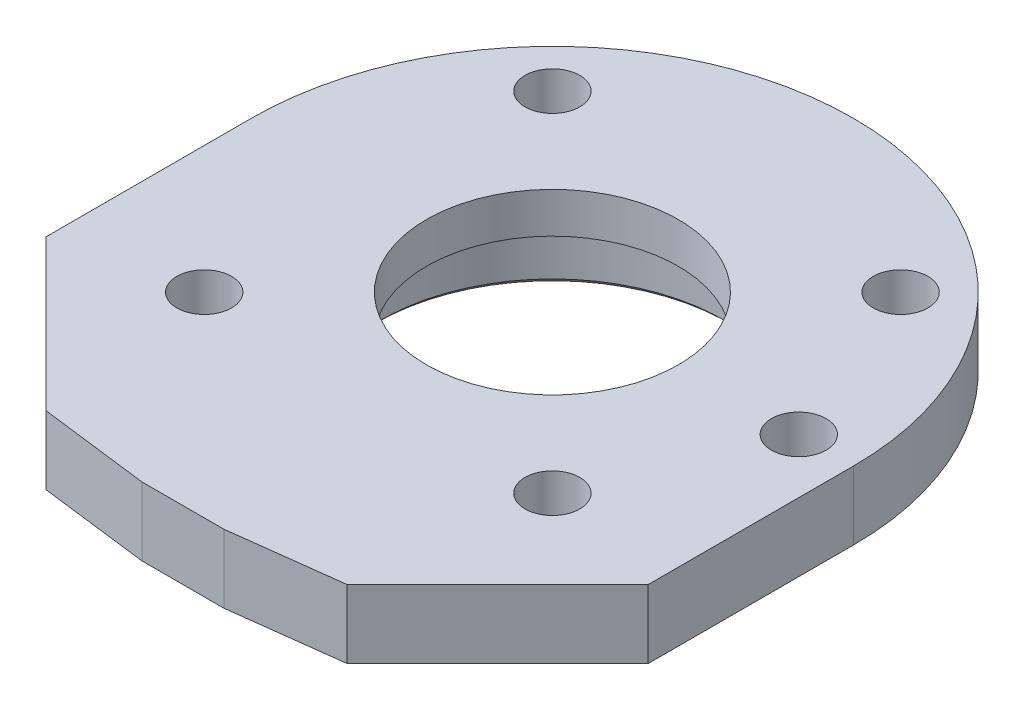
ISO-10303-21;
HEADER;
FILE_DESCRIPTION(('STEP AP214'),'2;1');
FILE_NAME('part.step','',(''),(''),'','','');
FILE_SCHEMA(('AUTOMOTIVE_DESIGN { 1 0 10303 214 1 1 1 1 }'));
ENDSEC;
DATA;
#1=APPLICATION_CONTEXT('core data for automotive mechanical design processes');
#2=APPLICATION_PROTOCOL_DEFINITION('international standard','automotive_design',2000,#1);
#3=PRODUCT_CONTEXT('',#1,'mechanical');
#4=PRODUCT('Part','Part','',(#3));
#5=PRODUCT_RELATED_PRODUCT_CATEGORY('part','',(#4));
#6=PRODUCT_DEFINITION_FORMATION('','',#4);
#7=PRODUCT_DEFINITION_CONTEXT('part definition',#1,'design');
#8=PRODUCT_DEFINITION('design','',#6,#7);
#9=PRODUCT_DEFINITION_SHAPE('','',#8);
#10=(LENGTH_UNIT() NAMED_UNIT(*) SI_UNIT(.MILLI.,.METRE.));
#11=(NAMED_UNIT(*) PLANE_ANGLE_UNIT() SI_UNIT($,.RADIAN.));
#12=(NAMED_UNIT(*) SI_UNIT($,.STERADIAN.) SOLID_ANGLE_UNIT());
#13=UNCERTAINTY_MEASURE_WITH_UNIT(LENGTH_MEASURE(1.E-05),#10,'distance_accuracy_value','');
#14=(GEOMETRIC_REPRESENTATION_CONTEXT(3) GLOBAL_UNCERTAINTY_ASSIGNED_CONTEXT((#13)) GLOBAL_UNIT_ASSIGNED_CONTEXT((#10,
#11,#12)) REPRESENTATION_CONTEXT('',''));
#15=CARTESIAN_POINT('',(0.,0.,0.));
#16=DIRECTION('',(0.,0.,1.));
#17=DIRECTION('',(1.,0.,0.));
#18=AXIS2_PLACEMENT_3D('',#15,#16,#17);
#19=CARTESIAN_POINT('',(0.,7.99999999999898,-8.32667268468867E-13));
#20=DIRECTION('',(0.,-1.,0.));
#21=DIRECTION('',(1.00000000000001,0.,0.));
#22=AXIS2_PLACEMENT_3D('',#19,#20,#21);
#23=CONICAL_SURFACE('',#22,64.499999999999,0.785398163396999);
#24=CARTESIAN_POINT('',(0.,7.99999999999898,-8.32667268468867E-13));
#25=DIRECTION('',(0.,-1.,0.));
#26=DIRECTION('',(1.00000000000001,0.,0.));
#27=AXIS2_PLACEMENT_3D('',#24,#25,#26);
#28=CIRCLE('',#27,64.499999999999);
#29=CARTESIAN_POINT('',(64.4999999999998,7.99999999999898,-8.32667268468868E-13));
#30=VERTEX_POINT('',#29);
#31=EDGE_CURVE('E19',#30,#30,#28,.T.);
#32=ORIENTED_EDGE('',*,*,#31,.T.);
#33=EDGE_LOOP('',(#32));
#34=FACE_BOUND('',#33,.T.);
#35=CARTESIAN_POINT('',(0.,9.99999999999999,-8.32667268468867E-13));
#36=DIRECTION('',(0.,1.,0.));
#37=DIRECTION('',(0.,0.,1.00000000000001));
#38=AXIS2_PLACEMENT_3D('',#35,#36,#37);
#39=CIRCLE('',#38,62.5);
#40=CARTESIAN_POINT('',(0.,9.99999999999999,62.5));
#41=VERTEX_POINT('',#40);
#42=EDGE_CURVE('E202',#41,#41,#39,.T.);
#43=ORIENTED_EDGE('',*,*,#42,.T.);
#44=EDGE_LOOP('',(#43));
#45=FACE_BOUND('',#44,.T.);
#46=ADVANCED_FACE('F16',(#34,#45),#23,.F.);
#47=CARTESIAN_POINT('',(0.,8.00000000000001,-8.32667268468867E-13));
#48=DIRECTION('',(0.,1.,0.));
#49=DIRECTION('',(0.,0.,1.00000000000001));
#50=AXIS2_PLACEMENT_3D('',#47,#48,#49);
#51=CYLINDRICAL_SURFACE('',#50,62.5);
#52=CARTESIAN_POINT('',(0.,33.2000000000001,-8.32667268468867E-13));
#53=DIRECTION('',(0.,1.,0.));
#54=DIRECTION('',(0.,0.,1.00000000000001));
#55=AXIS2_PLACEMENT_3D('',#52,#53,#54);
#56=CIRCLE('',#55,62.5);
#57=CARTESIAN_POINT('',(0.,33.2000000000001,62.5));
#58=VERTEX_POINT('',#57);
#59=EDGE_CURVE('E268',#58,#58,#56,.T.);
#60=ORIENTED_EDGE('',*,*,#59,.T.);
#61=EDGE_LOOP('',(#60));
#62=FACE_BOUND('',#61,.T.);
#63=ORIENTED_EDGE('',*,*,#42,.F.);
#64=EDGE_LOOP('',(#63));
#65=FACE_BOUND('',#64,.T.);
#66=ADVANCED_FACE('F281',(#62,#65),#51,.F.);
#67=CARTESIAN_POINT('',(0.,8.00000000000001,-8.32667268468867E-13));
#68=DIRECTION('',(0.,1.,0.));
#69=DIRECTION('',(0.,0.,1.00000000000001));
#70=AXIS2_PLACEMENT_3D('',#67,#68,#69);
#71=PLANE('',#70);
#72=ORIENTED_EDGE('',*,*,#31,.F.);
#73=EDGE_LOOP('',(#72));
#74=FACE_BOUND('',#73,.T.);
#75=CARTESIAN_POINT('',(0.,8.00000000000013,-8.32667268468867E-13));
#76=DIRECTION('',(0.,1.,0.));
#77=DIRECTION('',(0.,0.,1.00000000000001));
#78=AXIS2_PLACEMENT_3D('',#75,#76,#77);
#79=CIRCLE('',#78,72.9999999999999);
#80=CARTESIAN_POINT('',(0.,8.00000000000013,73.));
#81=VERTEX_POINT('',#80);
#82=EDGE_CURVE('E266',#81,#81,#79,.T.);
#83=ORIENTED_EDGE('',*,*,#82,.F.);
#84=EDGE_LOOP('',(#83));
#85=FACE_BOUND('',#84,.T.);
#86=ADVANCED_FACE('F277',(#74,#85),#71,.F.);
#87=CARTESIAN_POINT('',(0.,33.2000000000001,-8.32667268468867E-13));
#88=DIRECTION('',(0.,1.,0.));
#89=DIRECTION('',(0.,0.,1.00000000000001));
#90=AXIS2_PLACEMENT_3D('',#87,#88,#89);
#91=PLANE('',#90);
#92=CARTESIAN_POINT('',(0.,33.2000000000001,-8.32667268468867E-13));
#93=DIRECTION('',(0.,1.,0.));
#94=DIRECTION('',(0.,0.,1.00000000000001));
#95=AXIS2_PLACEMENT_3D('',#92,#93,#94);
#96=CIRCLE('',#95,59.);
#97=CARTESIAN_POINT('',(0.,33.2000000000001,59.));
#98=VERTEX_POINT('',#97);
#99=EDGE_CURVE('E201',#98,#98,#96,.T.);
#100=ORIENTED_EDGE('',*,*,#99,.T.);
#101=EDGE_LOOP('',(#100));
#102=FACE_BOUND('',#101,.T.);
#103=ORIENTED_EDGE('',*,*,#59,.F.);
#104=EDGE_LOOP('',(#103));
#105=FACE_BOUND('',#104,.T.);
#106=ADVANCED_FACE('F280',(#102,#105),#91,.F.);
#107=CARTESIAN_POINT('',(0.,10.000000000001,-8.32667268468867E-13));
#108=DIRECTION('',(0.,1.,0.));
#109=DIRECTION('',(0.,0.,1.00000000000001));
#110=AXIS2_PLACEMENT_3D('',#107,#108,#109);
#111=CONICAL_SURFACE('',#110,74.999999999999,0.785398163397);
#112=ORIENTED_EDGE('',*,*,#82,.T.);
#113=EDGE_LOOP('',(#112));
#114=FACE_BOUND('',#113,.T.);
#115=CARTESIAN_POINT('',(0.,10.,-8.32667268468867E-13));
#116=DIRECTION('',(0.,1.,0.));
#117=DIRECTION('',(0.,0.,1.00000000000001));
#118=AXIS2_PLACEMENT_3D('',#115,#116,#117);
#119=CIRCLE('',#118,75.);
#120=CARTESIAN_POINT('',(0.,10.,75.0000000000002));
#121=VERTEX_POINT('',#120);
#122=EDGE_CURVE('E197',#121,#121,#119,.T.);
#123=ORIENTED_EDGE('',*,*,#122,.F.);
#124=EDGE_LOOP('',(#123));
#125=FACE_BOUND('',#124,.T.);
#126=ADVANCED_FACE('F285',(#114,#125),#111,.T.);
#127=CARTESIAN_POINT('',(0.,33.2000000000001,-8.32667268468867E-13));
#128=DIRECTION('',(0.,1.,0.));
#129=DIRECTION('',(0.,0.,1.00000000000001));
#130=AXIS2_PLACEMENT_3D('',#127,#128,#129);
#131=CYLINDRICAL_SURFACE('',#130,59.);
#132=CARTESIAN_POINT('',(0.,35.2000000000001,-8.32667268468867E-13));
#133=DIRECTION('',(0.,1.,0.));
#134=DIRECTION('',(0.,0.,1.00000000000001));
#135=AXIS2_PLACEMENT_3D('',#132,#133,#134);
#136=CIRCLE('',#135,59.);
#137=CARTESIAN_POINT('',(0.,35.2000000000001,59.));
#138=VERTEX_POINT('',#137);
#139=EDGE_CURVE('E200',#138,#138,#136,.T.);
#140=ORIENTED_EDGE('',*,*,#139,.T.);
#141=EDGE_LOOP('',(#140));
#142=FACE_BOUND('',#141,.T.);
#143=ORIENTED_EDGE('',*,*,#99,.F.);
#144=EDGE_LOOP('',(#143));
#145=FACE_BOUND('',#144,.T.);
#146=ADVANCED_FACE('F288',(#142,#145),#131,.F.);
#147=CARTESIAN_POINT('',(0.,-497.410884005,0.));
#148=DIRECTION('',(0.,1.,0.));
#149=DIRECTION('',(0.,0.,1.00000000000001));
#150=AXIS2_PLACEMENT_3D('',#147,#148,#149);
#151=CYLINDRICAL_SURFACE('',#150,75.);
#152=CARTESIAN_POINT('',(0.,25.0000000000001,-8.32667268468867E-13));
#153=DIRECTION('',(0.,1.,0.));
#154=DIRECTION('',(0.,0.,1.00000000000001));
#155=AXIS2_PLACEMENT_3D('',#152,#153,#154);
#156=CIRCLE('',#155,75.);
#157=CARTESIAN_POINT('',(0.,25.0000000000001,75.0000000000002));
#158=VERTEX_POINT('',#157);
#159=EDGE_CURVE('E259',#158,#158,#156,.F.);
#160=ORIENTED_EDGE('',*,*,#159,.T.);
#161=EDGE_LOOP('',(#160));
#162=FACE_BOUND('',#161,.T.);
#163=ORIENTED_EDGE('',*,*,#122,.T.);
#164=EDGE_LOOP('',(#163));
#165=FACE_BOUND('',#164,.T.);
#166=ADVANCED_FACE('F292',(#162,#165),#151,.T.);
#167=CARTESIAN_POINT('',(63.600000000003,25.,-63.6000000000024));
#168=DIRECTION('',(0.,1.,0.));
#169=DIRECTION('',(0.,0.,1.00000000000001));
#170=AXIS2_PLACEMENT_3D('',#167,#168,#169);
#171=CYLINDRICAL_SURFACE('',#170,7.);
#172=CARTESIAN_POINT('',(63.600000000003,25.,-63.6000000000024));
#173=DIRECTION('',(0.,1.,0.));
#174=DIRECTION('',(0.,0.,1.00000000000001));
#175=AXIS2_PLACEMENT_3D('',#172,#173,#174);
#176=CIRCLE('',#175,7.);
#177=CARTESIAN_POINT('',(63.600000000003,25.,-56.6000000000023));
#178=VERTEX_POINT('',#177);
#179=EDGE_CURVE('E256',#178,#178,#176,.F.);
#180=ORIENTED_EDGE('',*,*,#179,.T.);
#181=EDGE_LOOP('',(#180));
#182=FACE_BOUND('',#181,.T.);
#183=CARTESIAN_POINT('',(63.600000000003,33.9999999999999,-63.6000000000018));
#184=DIRECTION('',(0.,1.,0.));
#185=DIRECTION('',(0.,0.,1.00000000000001));
#186=AXIS2_PLACEMENT_3D('',#183,#184,#185);
#187=CIRCLE('',#186,7.);
#188=CARTESIAN_POINT('',(63.600000000003,33.9999999999999,-56.6000000000017));
#189=VERTEX_POINT('',#188);
#190=EDGE_CURVE('E244',#189,#189,#187,.T.);
#191=ORIENTED_EDGE('',*,*,#190,.T.);
#192=EDGE_LOOP('',(#191));
#193=FACE_BOUND('',#192,.T.);
#194=ADVANCED_FACE('F294',(#182,#193),#171,.F.);
#195=CARTESIAN_POINT('',(-63.6,25.,-63.6000000000022));
#196=DIRECTION('',(0.,-1.,0.));
#197=DIRECTION('',(0.,0.,-1.00000000000001));
#198=AXIS2_PLACEMENT_3D('',#195,#196,#197);
#199=CYLINDRICAL_SURFACE('',#198,7.);
#200=CARTESIAN_POINT('',(-63.6,25.,-63.6000000000022));
#201=DIRECTION('',(0.,-1.,0.));
#202=DIRECTION('',(0.,0.,-1.00000000000001));
#203=AXIS2_PLACEMENT_3D('',#200,#201,#202);
#204=CIRCLE('',#203,7.);
#205=CARTESIAN_POINT('',(-63.6,25.,-70.6000000000023));
#206=VERTEX_POINT('',#205);
#207=EDGE_CURVE('E253',#206,#206,#204,.T.);
#208=ORIENTED_EDGE('',*,*,#207,.T.);
#209=EDGE_LOOP('',(#208));
#210=FACE_BOUND('',#209,.T.);
#211=CARTESIAN_POINT('',(-63.6,34.,-63.6000000000022));
#212=DIRECTION('',(0.,-1.,0.));
#213=DIRECTION('',(0.,0.,-1.00000000000001));
#214=AXIS2_PLACEMENT_3D('',#211,#212,#213);
#215=CIRCLE('',#214,7.);
#216=CARTESIAN_POINT('',(-63.6,34.,-70.6000000000023));
#217=VERTEX_POINT('',#216);
#218=EDGE_CURVE('E241',#217,#217,#215,.T.);
#219=ORIENTED_EDGE('',*,*,#218,.F.);
#220=EDGE_LOOP('',(#219));
#221=FACE_BOUND('',#220,.T.);
#222=ADVANCED_FACE('F302',(#210,#221),#199,.F.);
#223=CARTESIAN_POINT('',(-63.6000000000004,25.,63.6000000000002));
#224=DIRECTION('',(0.,1.,0.));
#225=DIRECTION('',(0.,0.,1.00000000000001));
#226=AXIS2_PLACEMENT_3D('',#223,#224,#225);
#227=CYLINDRICAL_SURFACE('',#226,7.);
#228=CARTESIAN_POINT('',(-63.6000000000004,25.,63.6000000000002));
#229=DIRECTION('',(0.,1.,0.));
#230=DIRECTION('',(0.,0.,1.00000000000001));
#231=AXIS2_PLACEMENT_3D('',#228,#229,#230);
#232=CIRCLE('',#231,7.);
#233=CARTESIAN_POINT('',(-63.6000000000004,25.,70.6000000000003));
#234=VERTEX_POINT('',#233);
#235=EDGE_CURVE('E250',#234,#234,#232,.F.);
#236=ORIENTED_EDGE('',*,*,#235,.T.);
#237=EDGE_LOOP('',(#236));
#238=FACE_BOUND('',#237,.T.);
#239=CARTESIAN_POINT('',(-63.6000000000004,34.0000000000001,63.6000000000002));
#240=DIRECTION('',(0.,1.,0.));
#241=DIRECTION('',(0.,0.,1.00000000000001));
#242=AXIS2_PLACEMENT_3D('',#239,#240,#241);
#243=CIRCLE('',#242,7.);
#244=CARTESIAN_POINT('',(-63.6000000000004,34.0000000000001,70.6000000000003));
#245=VERTEX_POINT('',#244);
#246=EDGE_CURVE('E238',#245,#245,#243,.T.);
#247=ORIENTED_EDGE('',*,*,#246,.T.);
#248=EDGE_LOOP('',(#247));
#249=FACE_BOUND('',#248,.T.);
#250=ADVANCED_FACE('F391',(#238,#249),#227,.F.);
#251=CARTESIAN_POINT('',(63.6000000000017,25.,63.6000000000001));
#252=DIRECTION('',(0.,-1.,0.));
#253=DIRECTION('',(0.,0.,-1.00000000000001));
#254=AXIS2_PLACEMENT_3D('',#251,#252,#253);
#255=CYLINDRICAL_SURFACE('',#254,7.);
#256=CARTESIAN_POINT('',(63.6000000000017,25.,63.6000000000001));
#257=DIRECTION('',(0.,-1.,0.));
#258=DIRECTION('',(0.,0.,-1.00000000000001));
#259=AXIS2_PLACEMENT_3D('',#256,#257,#258);
#260=CIRCLE('',#259,7.);
#261=CARTESIAN_POINT('',(63.6000000000017,25.,56.6));
#262=VERTEX_POINT('',#261);
#263=EDGE_CURVE('E247',#262,#262,#260,.T.);
#264=ORIENTED_EDGE('',*,*,#263,.T.);
#265=EDGE_LOOP('',(#264));
#266=FACE_BOUND('',#265,.T.);
#267=CARTESIAN_POINT('',(63.6000000000017,34.,63.6000000000007));
#268=DIRECTION('',(0.,-1.,0.));
#269=DIRECTION('',(0.,0.,-1.00000000000001));
#270=AXIS2_PLACEMENT_3D('',#267,#268,#269);
#271=CIRCLE('',#270,7.);
#272=CARTESIAN_POINT('',(63.6000000000017,34.,56.6000000000006));
#273=VERTEX_POINT('',#272);
#274=EDGE_CURVE('E179',#273,#273,#271,.T.);
#275=ORIENTED_EDGE('',*,*,#274,.F.);
#276=EDGE_LOOP('',(#275));
#277=FACE_BOUND('',#276,.T.);
#278=ADVANCED_FACE('F387',(#266,#277),#255,.F.);
#279=CARTESIAN_POINT('',(0.,35.2000000000001,-8.32667268468867E-13));
#280=DIRECTION('',(0.,1.,0.));
#281=DIRECTION('',(0.,0.,1.00000000000001));
#282=AXIS2_PLACEMENT_3D('',#279,#280,#281);
#283=PLANE('',#282);
#284=CARTESIAN_POINT('',(0.,35.2000000000001,-8.32667268468867E-13));
#285=DIRECTION('',(0.,1.,0.));
#286=DIRECTION('',(0.,0.,1.00000000000001));
#287=AXIS2_PLACEMENT_3D('',#284,#285,#286);
#288=CIRCLE('',#287,46.);
#289=CARTESIAN_POINT('',(0.,35.2000000000001,45.9999999999998));
#290=VERTEX_POINT('',#289);
#291=EDGE_CURVE('E231',#290,#290,#288,.T.);
#292=ORIENTED_EDGE('',*,*,#291,.T.);
#293=EDGE_LOOP('',(#292));
#294=FACE_BOUND('',#293,.T.);
#295=ORIENTED_EDGE('',*,*,#139,.F.);
#296=EDGE_LOOP('',(#295));
#297=FACE_BOUND('',#296,.T.);
#298=ADVANCED_FACE('F383',(#294,#297),#283,.F.);
#299=CARTESIAN_POINT('',(0.,25.0000000000001,-8.32667268468867E-13));
#300=DIRECTION('',(0.,1.,0.));
#301=DIRECTION('',(0.,0.,1.00000000000001));
#302=AXIS2_PLACEMENT_3D('',#299,#300,#301);
#303=PLANE('',#302);
#304=CARTESIAN_POINT('',(90.0000000000017,25.,-8.32667268468867E-13));
#305=DIRECTION('',(0.,1.,0.));
#306=DIRECTION('',(0.,0.,1.00000000000001));
#307=AXIS2_PLACEMENT_3D('',#304,#305,#306);
#308=CIRCLE('',#307,10.);
#309=CARTESIAN_POINT('',(90.0000000000017,25.,9.9999999999993));
#310=VERTEX_POINT('',#309);
#311=EDGE_CURVE('E228',#310,#310,#308,.T.);
#312=ORIENTED_EDGE('',*,*,#311,.T.);
#313=EDGE_LOOP('',(#312));
#314=FACE_BOUND('',#313,.T.);
#315=ORIENTED_EDGE('',*,*,#263,.F.);
#316=EDGE_LOOP('',(#315));
#317=FACE_BOUND('',#316,.T.);
#318=ORIENTED_EDGE('',*,*,#235,.F.);
#319=EDGE_LOOP('',(#318));
#320=FACE_BOUND('',#319,.T.);
#321=ORIENTED_EDGE('',*,*,#207,.F.);
#322=EDGE_LOOP('',(#321));
#323=FACE_BOUND('',#322,.T.);
#324=ORIENTED_EDGE('',*,*,#179,.F.);
#325=EDGE_LOOP('',(#324));
#326=FACE_BOUND('',#325,.T.);
#327=ORIENTED_EDGE('',*,*,#159,.F.);
#328=EDGE_LOOP('',(#327));
#329=FACE_BOUND('',#328,.T.);
#330=DIRECTION('',(0.707106781186554,0.,-0.707106781186554));
#331=VECTOR('',#330,1.);
#332=CARTESIAN_POINT('',(55.0000000000033,25.,130.));
#333=LINE('',#332,#331);
#334=CARTESIAN_POINT('',(55.0000000000037,25.,130.000000000003));
#335=VERTEX_POINT('',#334);
#336=CARTESIAN_POINT('',(110.000000000003,25.,75.0000000000001));
#337=VERTEX_POINT('',#336);
#338=EDGE_CURVE('E64',#335,#337,#333,.T.);
#339=ORIENTED_EDGE('',*,*,#338,.F.);
#340=DIRECTION('',(0.992277876713712,0.,-0.124034734588964));
#341=VECTOR('',#340,1.);
#342=CARTESIAN_POINT('',(15.,25.,135.000000000001));
#343=LINE('',#342,#341);
#344=CARTESIAN_POINT('',(15.,25.,135.000000000001));
#345=VERTEX_POINT('',#344);
#346=EDGE_CURVE('E141',#345,#335,#343,.T.);
#347=ORIENTED_EDGE('',*,*,#346,.F.);
#348=DIRECTION('',(1.00000000000001,0.,0.));
#349=VECTOR('',#348,1.);
#350=CARTESIAN_POINT('',(-15.,25.,135.));
#351=LINE('',#350,#349);
#352=CARTESIAN_POINT('',(-14.9999999999996,25.,134.999999999997));
#353=VERTEX_POINT('',#352);
#354=EDGE_CURVE('E152',#353,#345,#351,.T.);
#355=ORIENTED_EDGE('',*,*,#354,.F.);
#356=DIRECTION('',(0.992277876713712,0.,0.124034734588964));
#357=VECTOR('',#356,1.);
#358=CARTESIAN_POINT('',(-55.,25.,130.));
#359=LINE('',#358,#357);
#360=CARTESIAN_POINT('',(-55.,25.,130.));
#361=VERTEX_POINT('',#360);
#362=EDGE_CURVE('E162',#361,#353,#359,.T.);
#363=ORIENTED_EDGE('',*,*,#362,.F.);
#364=DIRECTION('',(0.707106781186554,0.,0.707106781186554));
#365=VECTOR('',#364,1.);
#366=CARTESIAN_POINT('',(-110.000000000001,25.,75.0000000000002));
#367=LINE('',#366,#365);
#368=CARTESIAN_POINT('',(-110.000000000001,25.,75.0000000000002));
#369=VERTEX_POINT('',#368);
#370=EDGE_CURVE('E97',#369,#361,#367,.T.);
#371=ORIENTED_EDGE('',*,*,#370,.F.);
#372=DIRECTION('',(0.,0.,1.00000000000001));
#373=VECTOR('',#372,1.);
#374=CARTESIAN_POINT('',(-110.000000000001,25.,-7.49400541621981E-13));
#375=LINE('',#374,#373);
#376=CARTESIAN_POINT('',(-110.000000000001,25.,-7.21644966006352E-13));
#377=VERTEX_POINT('',#376);
#378=EDGE_CURVE('E56',#377,#369,#375,.T.);
#379=ORIENTED_EDGE('',*,*,#378,.F.);
#380=CARTESIAN_POINT('',(0.,25.0000000000001,-8.32667268468867E-13));
#381=DIRECTION('',(0.,1.,0.));
#382=DIRECTION('',(0.,0.,1.00000000000001));
#383=AXIS2_PLACEMENT_3D('',#380,#381,#382);
#384=CIRCLE('',#383,110.);
#385=CARTESIAN_POINT('',(110.000000000003,25.,-7.49400541621981E-13));
#386=VERTEX_POINT('',#385);
#387=EDGE_CURVE('E127',#386,#377,#384,.T.);
#388=ORIENTED_EDGE('',*,*,#387,.F.);
#389=DIRECTION('',(0.,0.,-1.00000000000001));
#390=VECTOR('',#389,1.);
#391=CARTESIAN_POINT('',(110.000000000003,25.,75.0000000000001));
#392=LINE('',#391,#390);
#393=EDGE_CURVE('E49',#337,#386,#392,.T.);
#394=ORIENTED_EDGE('',*,*,#393,.F.);
#395=EDGE_LOOP('',(#339,#347,#355,#363,#371,#379,#388,#394));
#396=FACE_BOUND('',#395,.T.);
#397=ADVANCED_FACE('F379',(#314,#317,#320,#323,#326,#329,#396),#303,.F.);
#398=CARTESIAN_POINT('',(63.600000000003,33.9999999999999,-63.6000000000018));
#399=DIRECTION('',(0.,-1.,0.));
#400=DIRECTION('',(0.,0.,-1.00000000000001));
#401=AXIS2_PLACEMENT_3D('',#398,#399,#400);
#402=PLANE('',#401);
#403=ORIENTED_EDGE('',*,*,#190,.F.);
#404=EDGE_LOOP('',(#403));
#405=FACE_BOUND('',#404,.T.);
#406=CARTESIAN_POINT('',(63.600000000003,33.9999999999999,-63.6000000000018));
#407=DIRECTION('',(0.,-1.,0.));
#408=DIRECTION('',(0.,0.,-1.00000000000001));
#409=AXIS2_PLACEMENT_3D('',#406,#407,#408);
#410=CIRCLE('',#409,10.);
#411=CARTESIAN_POINT('',(63.600000000003,33.9999999999999,-73.6000000000019));
#412=VERTEX_POINT('',#411);
#413=EDGE_CURVE('E225',#412,#412,#410,.F.);
#414=ORIENTED_EDGE('',*,*,#413,.T.);
#415=EDGE_LOOP('',(#414));
#416=FACE_BOUND('',#415,.T.);
#417=ADVANCED_FACE('F375',(#405,#416),#402,.F.);
#418=CARTESIAN_POINT('',(-63.6,34.,-63.6000000000022));
#419=DIRECTION('',(0.,1.,0.));
#420=DIRECTION('',(0.,0.,1.00000000000001));
#421=AXIS2_PLACEMENT_3D('',#418,#419,#420);
#422=PLANE('',#421);
#423=ORIENTED_EDGE('',*,*,#218,.T.);
#424=EDGE_LOOP('',(#423));
#425=FACE_BOUND('',#424,.T.);
#426=CARTESIAN_POINT('',(-63.6,34.,-63.6000000000022));
#427=DIRECTION('',(0.,1.,0.));
#428=DIRECTION('',(0.,0.,1.00000000000001));
#429=AXIS2_PLACEMENT_3D('',#426,#427,#428);
#430=CIRCLE('',#429,10.);
#431=CARTESIAN_POINT('',(-63.6,34.,-53.6000000000021));
#432=VERTEX_POINT('',#431);
#433=EDGE_CURVE('E222',#432,#432,#430,.T.);
#434=ORIENTED_EDGE('',*,*,#433,.T.);
#435=EDGE_LOOP('',(#434));
#436=FACE_BOUND('',#435,.T.);
#437=ADVANCED_FACE('F371',(#425,#436),#422,.T.);
#438=CARTESIAN_POINT('',(-63.6000000000004,34.0000000000001,63.6000000000002));
#439=DIRECTION('',(0.,-1.,0.));
#440=DIRECTION('',(0.,0.,-1.00000000000001));
#441=AXIS2_PLACEMENT_3D('',#438,#439,#440);
#442=PLANE('',#441);
#443=ORIENTED_EDGE('',*,*,#246,.F.);
#444=EDGE_LOOP('',(#443));
#445=FACE_BOUND('',#444,.T.);
#446=CARTESIAN_POINT('',(-63.6000000000004,34.0000000000001,63.6000000000002));
#447=DIRECTION('',(0.,-1.,0.));
#448=DIRECTION('',(0.,0.,-1.00000000000001));
#449=AXIS2_PLACEMENT_3D('',#446,#447,#448);
#450=CIRCLE('',#449,10.);
#451=CARTESIAN_POINT('',(-63.6000000000004,34.0000000000001,53.6000000000001));
#452=VERTEX_POINT('',#451);
#453=EDGE_CURVE('E116',#452,#452,#450,.F.);
#454=ORIENTED_EDGE('',*,*,#453,.T.);
#455=EDGE_LOOP('',(#454));
#456=FACE_BOUND('',#455,.T.);
#457=ADVANCED_FACE('F367',(#445,#456),#442,.F.);
#458=CARTESIAN_POINT('',(63.6000000000017,34.,63.6000000000007));
#459=DIRECTION('',(0.,1.,0.));
#460=DIRECTION('',(0.,0.,1.00000000000001));
#461=AXIS2_PLACEMENT_3D('',#458,#459,#460);
#462=PLANE('',#461);
#463=ORIENTED_EDGE('',*,*,#274,.T.);
#464=EDGE_LOOP('',(#463));
#465=FACE_BOUND('',#464,.T.);
#466=CARTESIAN_POINT('',(63.6000000000017,34.,63.6000000000007));
#467=DIRECTION('',(0.,1.,0.));
#468=DIRECTION('',(0.,0.,1.00000000000001));
#469=AXIS2_PLACEMENT_3D('',#466,#467,#468);
#470=CIRCLE('',#469,10.);
#471=CARTESIAN_POINT('',(63.6000000000017,34.,73.6000000000008));
#472=VERTEX_POINT('',#471);
#473=EDGE_CURVE('E113',#472,#472,#470,.T.);
#474=ORIENTED_EDGE('',*,*,#473,.T.);
#475=EDGE_LOOP('',(#474));
#476=FACE_BOUND('',#475,.T.);
#477=ADVANCED_FACE('F364',(#465,#476),#462,.T.);
#478=CARTESIAN_POINT('',(-110.000000000001,0.,-7.49400541621981E-13));
#479=DIRECTION('',(-1.00000000000001,0.,0.));
#480=DIRECTION('',(0.,0.,1.00000000000001));
#481=AXIS2_PLACEMENT_3D('',#478,#479,#480);
#482=PLANE('',#481);
#483=DIRECTION('',(0.,1.,0.));
#484=VECTOR('',#483,1.);
#485=CARTESIAN_POINT('',(-110.000000000001,0.,-6.66133814775094E-13));
#486=LINE('',#485,#484);
#487=CARTESIAN_POINT('',(-110.000000000001,50.,-7.21644966006352E-13));
#488=VERTEX_POINT('',#487);
#489=EDGE_CURVE('E124',#377,#488,#486,.T.);
#490=ORIENTED_EDGE('',*,*,#489,.F.);
#491=ORIENTED_EDGE('',*,*,#378,.T.);
#492=DIRECTION('',(0.,1.,0.));
#493=VECTOR('',#492,1.);
#494=CARTESIAN_POINT('',(-110.000000000001,0.,75.0000000000002));
#495=LINE('',#494,#493);
#496=CARTESIAN_POINT('',(-110.000000000001,50.0000000000001,75.0000000000001));
#497=VERTEX_POINT('',#496);
#498=EDGE_CURVE('E90',#497,#369,#495,.F.);
#499=ORIENTED_EDGE('',*,*,#498,.F.);
#500=DIRECTION('',(0.,0.,1.00000000000001));
#501=VECTOR('',#500,1.);
#502=CARTESIAN_POINT('',(-110.000000000001,50.,-7.49400541621981E-13));
#503=LINE('',#502,#501);
#504=EDGE_CURVE('E94',#488,#497,#503,.T.);
#505=ORIENTED_EDGE('',*,*,#504,.F.);
#506=EDGE_LOOP('',(#490,#491,#499,#505));
#507=FACE_BOUND('',#506,.T.);
#508=ADVANCED_FACE('F92',(#507),#482,.T.);
#509=CARTESIAN_POINT('',(-110.000000000001,0.,75.0000000000002));
#510=DIRECTION('',(-0.707106781186554,0.,0.707106781186554));
#511=DIRECTION('',(0.707106781186554,0.,0.707106781186554));
#512=AXIS2_PLACEMENT_3D('',#509,#510,#511);
#513=PLANE('',#512);
#514=ORIENTED_EDGE('',*,*,#498,.T.);
#515=ORIENTED_EDGE('',*,*,#370,.T.);
#516=DIRECTION('',(0.,1.,0.));
#517=VECTOR('',#516,1.);
#518=CARTESIAN_POINT('',(-55.,0.,130.));
#519=LINE('',#518,#517);
#520=CARTESIAN_POINT('',(-55.,50.,130.));
#521=VERTEX_POINT('',#520);
#522=EDGE_CURVE('E103',#521,#361,#519,.F.);
#523=ORIENTED_EDGE('',*,*,#522,.F.);
#524=DIRECTION('',(0.707106781186554,0.,0.707106781186554));
#525=VECTOR('',#524,1.);
#526=CARTESIAN_POINT('',(-110.000000000001,50.0000000000001,75.0000000000002));
#527=LINE('',#526,#525);
#528=EDGE_CURVE('E100',#497,#521,#527,.T.);
#529=ORIENTED_EDGE('',*,*,#528,.F.);
#530=EDGE_LOOP('',(#514,#515,#523,#529));
#531=FACE_BOUND('',#530,.T.);
#532=ADVANCED_FACE('F101',(#531),#513,.T.);
#533=CARTESIAN_POINT('',(-55.,0.,130.));
#534=DIRECTION('',(-0.124034734588964,0.,0.992277876713712));
#535=DIRECTION('',(0.992277876713712,0.,0.124034734588964));
#536=AXIS2_PLACEMENT_3D('',#533,#534,#535);
#537=PLANE('',#536);
#538=ORIENTED_EDGE('',*,*,#522,.T.);
#539=ORIENTED_EDGE('',*,*,#362,.T.);
#540=DIRECTION('',(0.,1.,0.));
#541=VECTOR('',#540,1.);
#542=CARTESIAN_POINT('',(-15.,0.,135.));
#543=LINE('',#542,#541);
#544=CARTESIAN_POINT('',(-15.0000000000001,50.,135.000000000001));
#545=VERTEX_POINT('',#544);
#546=EDGE_CURVE('E159',#545,#353,#543,.F.);
#547=ORIENTED_EDGE('',*,*,#546,.F.);
#548=DIRECTION('',(0.992277876713681,0.,0.12403473458921));
#549=VECTOR('',#548,1.);
#550=CARTESIAN_POINT('',(-55.,50.,130.));
#551=LINE('',#550,#549);
#552=EDGE_CURVE('E107',#521,#545,#551,.T.);
#553=ORIENTED_EDGE('',*,*,#552,.F.);
#554=EDGE_LOOP('',(#538,#539,#547,#553));
#555=FACE_BOUND('',#554,.T.);
#556=ADVANCED_FACE('F355',(#555),#537,.T.);
#557=CARTESIAN_POINT('',(-15.,0.,135.));
#558=DIRECTION('',(0.,0.,1.00000000000001));
#559=DIRECTION('',(1.00000000000001,0.,0.));
#560=AXIS2_PLACEMENT_3D('',#557,#558,#559);
#561=PLANE('',#560);
#562=ORIENTED_EDGE('',*,*,#546,.T.);
#563=ORIENTED_EDGE('',*,*,#354,.T.);
#564=DIRECTION('',(0.,1.,0.));
#565=VECTOR('',#564,1.);
#566=CARTESIAN_POINT('',(15.,0.,135.000000000001));
#567=LINE('',#566,#565);
#568=CARTESIAN_POINT('',(15.,50.,135.000000000001));
#569=VERTEX_POINT('',#568);
#570=EDGE_CURVE('E149',#569,#345,#567,.F.);
#571=ORIENTED_EDGE('',*,*,#570,.F.);
#572=DIRECTION('',(1.00000000000001,0.,0.));
#573=VECTOR('',#572,1.);
#574=CARTESIAN_POINT('',(0.,50.,135.));
#575=LINE('',#574,#573);
#576=EDGE_CURVE('E146',#545,#569,#575,.T.);
#577=ORIENTED_EDGE('',*,*,#576,.F.);
#578=EDGE_LOOP('',(#562,#563,#571,#577));
#579=FACE_BOUND('',#578,.T.);
#580=ADVANCED_FACE('F351',(#579),#561,.T.);
#581=CARTESIAN_POINT('',(15.,0.,135.000000000001));
#582=DIRECTION('',(0.124034734588964,0.,0.992277876713712));
#583=DIRECTION('',(0.992277876713712,0.,-0.124034734588964));
#584=AXIS2_PLACEMENT_3D('',#581,#582,#583);
#585=PLANE('',#584);
#586=ORIENTED_EDGE('',*,*,#570,.T.);
#587=ORIENTED_EDGE('',*,*,#346,.T.);
#588=DIRECTION('',(0.,1.,0.));
#589=VECTOR('',#588,1.);
#590=CARTESIAN_POINT('',(55.0000000000033,0.,130.));
#591=LINE('',#590,#589);
#592=CARTESIAN_POINT('',(55.0000000000033,50.,130.));
#593=VERTEX_POINT('',#592);
#594=EDGE_CURVE('E139',#593,#335,#591,.F.);
#595=ORIENTED_EDGE('',*,*,#594,.F.);
#596=DIRECTION('',(0.992277876713681,0.,-0.12403473458921));
#597=VECTOR('',#596,1.);
#598=CARTESIAN_POINT('',(15.,50.,135.000000000001));
#599=LINE('',#598,#597);
#600=EDGE_CURVE('E136',#569,#593,#599,.T.);
#601=ORIENTED_EDGE('',*,*,#600,.F.);
#602=EDGE_LOOP('',(#586,#587,#595,#601));
#603=FACE_BOUND('',#602,.T.);
#604=ADVANCED_FACE('F348',(#603),#585,.T.);
#605=CARTESIAN_POINT('',(55.0000000000033,0.,130.));
#606=DIRECTION('',(0.707106781186554,0.,0.707106781186554));
#607=DIRECTION('',(0.707106781186554,0.,-0.707106781186554));
#608=AXIS2_PLACEMENT_3D('',#605,#606,#607);
#609=PLANE('',#608);
#610=ORIENTED_EDGE('',*,*,#594,.T.);
#611=ORIENTED_EDGE('',*,*,#338,.T.);
#612=DIRECTION('',(0.,1.,0.));
#613=VECTOR('',#612,1.);
#614=CARTESIAN_POINT('',(110.000000000003,0.,75.0000000000001));
#615=LINE('',#614,#613);
#616=CARTESIAN_POINT('',(110.000000000003,50.,75.0000000000001));
#617=VERTEX_POINT('',#616);
#618=EDGE_CURVE('E128',#617,#337,#615,.F.);
#619=ORIENTED_EDGE('',*,*,#618,.F.);
#620=DIRECTION('',(0.707106781186554,0.,-0.707106781186554));
#621=VECTOR('',#620,1.);
#622=CARTESIAN_POINT('',(55.0000000000033,50.,130.));
#623=LINE('',#622,#621);
#624=EDGE_CURVE('E132',#593,#617,#623,.T.);
#625=ORIENTED_EDGE('',*,*,#624,.F.);
#626=EDGE_LOOP('',(#610,#611,#619,#625));
#627=FACE_BOUND('',#626,.T.);
#628=ADVANCED_FACE('F345',(#627),#609,.T.);
#629=CARTESIAN_POINT('',(110.000000000003,0.,75.0000000000001));
#630=DIRECTION('',(1.00000000000001,0.,0.));
#631=DIRECTION('',(0.,0.,-1.00000000000001));
#632=AXIS2_PLACEMENT_3D('',#629,#630,#631);
#633=PLANE('',#632);
#634=ORIENTED_EDGE('',*,*,#618,.T.);
#635=ORIENTED_EDGE('',*,*,#393,.T.);
#636=DIRECTION('',(0.,1.,0.));
#637=VECTOR('',#636,1.);
#638=CARTESIAN_POINT('',(110.000000000003,1.52655665885959E-13,0.));
#639=LINE('',#638,#637);
#640=CARTESIAN_POINT('',(110.000000000003,50.,-7.49400541621981E-13));
#641=VERTEX_POINT('',#640);
#642=EDGE_CURVE('E34',#641,#386,#639,.F.);
#643=ORIENTED_EDGE('',*,*,#642,.F.);
#644=DIRECTION('',(0.,0.,1.00000000000001));
#645=VECTOR('',#644,1.);
#646=CARTESIAN_POINT('',(110.000000000003,50.,-7.49400541621981E-13));
#647=LINE('',#646,#645);
#648=EDGE_CURVE('E135',#617,#641,#647,.F.);
#649=ORIENTED_EDGE('',*,*,#648,.F.);
#650=EDGE_LOOP('',(#634,#635,#643,#649));
#651=FACE_BOUND('',#650,.T.);
#652=ADVANCED_FACE('F341',(#651),#633,.T.);
#653=CARTESIAN_POINT('',(0.,0.,0.));
#654=DIRECTION('',(0.,1.,0.));
#655=DIRECTION('',(0.,0.,1.00000000000001));
#656=AXIS2_PLACEMENT_3D('',#653,#654,#655);
#657=CYLINDRICAL_SURFACE('',#656,110.);
#658=ORIENTED_EDGE('',*,*,#642,.T.);
#659=ORIENTED_EDGE('',*,*,#387,.T.);
#660=ORIENTED_EDGE('',*,*,#489,.T.);
#661=CARTESIAN_POINT('',(0.,50.0000000000001,-8.32667268468867E-13));
#662=DIRECTION('',(0.,1.,0.));
#663=DIRECTION('',(0.,0.,1.00000000000001));
#664=AXIS2_PLACEMENT_3D('',#661,#662,#663);
#665=CIRCLE('',#664,110.);
#666=EDGE_CURVE('E112',#641,#488,#665,.T.);
#667=ORIENTED_EDGE('',*,*,#666,.F.);
#668=EDGE_LOOP('',(#658,#659,#660,#667));
#669=FACE_BOUND('',#668,.T.);
#670=ADVANCED_FACE('F337',(#669),#657,.T.);
#671=CARTESIAN_POINT('',(0.,0.,0.));
#672=DIRECTION('',(0.,1.,0.));
#673=DIRECTION('',(0.,0.,1.00000000000001));
#674=AXIS2_PLACEMENT_3D('',#671,#672,#673);
#675=CYLINDRICAL_SURFACE('',#674,46.);
#676=CARTESIAN_POINT('',(0.,50.0000000000001,-8.32667268468867E-13));
#677=DIRECTION('',(0.,1.,0.));
#678=DIRECTION('',(0.,0.,1.00000000000001));
#679=AXIS2_PLACEMENT_3D('',#676,#677,#678);
#680=CIRCLE('',#679,46.);
#681=CARTESIAN_POINT('',(0.,50.0000000000001,45.9999999999998));
#682=VERTEX_POINT('',#681);
#683=EDGE_CURVE('E216',#682,#682,#680,.F.);
#684=ORIENTED_EDGE('',*,*,#683,.F.);
#685=EDGE_LOOP('',(#684));
#686=FACE_BOUND('',#685,.T.);
#687=ORIENTED_EDGE('',*,*,#291,.F.);
#688=EDGE_LOOP('',(#687));
#689=FACE_BOUND('',#688,.T.);
#690=ADVANCED_FACE('F333',(#686,#689),#675,.F.);
#691=CARTESIAN_POINT('',(90.0000000000017,25.,-8.32667268468867E-13));
#692=DIRECTION('',(0.,1.,0.));
#693=DIRECTION('',(0.,0.,1.00000000000001));
#694=AXIS2_PLACEMENT_3D('',#691,#692,#693);
#695=CYLINDRICAL_SURFACE('',#694,10.);
#696=ORIENTED_EDGE('',*,*,#311,.F.);
#697=EDGE_LOOP('',(#696));
#698=FACE_BOUND('',#697,.T.);
#699=CARTESIAN_POINT('',(90.0000000000017,50.,-8.32667268468867E-13));
#700=DIRECTION('',(0.,1.,0.));
#701=DIRECTION('',(0.,0.,1.00000000000001));
#702=AXIS2_PLACEMENT_3D('',#699,#700,#701);
#703=CIRCLE('',#702,10.);
#704=CARTESIAN_POINT('',(90.0000000000017,50.,9.9999999999993));
#705=VERTEX_POINT('',#704);
#706=EDGE_CURVE('E213',#705,#705,#703,.F.);
#707=ORIENTED_EDGE('',*,*,#706,.F.);
#708=EDGE_LOOP('',(#707));
#709=FACE_BOUND('',#708,.T.);
#710=ADVANCED_FACE('F329',(#698,#709),#695,.F.);
#711=CARTESIAN_POINT('',(63.600000000003,50.,-63.6000000000018));
#712=DIRECTION('',(0.,-1.,0.));
#713=DIRECTION('',(0.,0.,-1.00000000000001));
#714=AXIS2_PLACEMENT_3D('',#711,#712,#713);
#715=CYLINDRICAL_SURFACE('',#714,10.);
#716=ORIENTED_EDGE('',*,*,#413,.F.);
#717=EDGE_LOOP('',(#716));
#718=FACE_BOUND('',#717,.T.);
#719=CARTESIAN_POINT('',(63.600000000003,50.,-63.6000000000018));
#720=DIRECTION('',(0.,-1.,0.));
#721=DIRECTION('',(0.,0.,-1.00000000000001));
#722=AXIS2_PLACEMENT_3D('',#719,#720,#721);
#723=CIRCLE('',#722,10.);
#724=CARTESIAN_POINT('',(63.600000000003,50.,-73.6000000000019));
#725=VERTEX_POINT('',#724);
#726=EDGE_CURVE('E210',#725,#725,#723,.T.);
#727=ORIENTED_EDGE('',*,*,#726,.F.);
#728=EDGE_LOOP('',(#727));
#729=FACE_BOUND('',#728,.T.);
#730=ADVANCED_FACE('F325',(#718,#729),#715,.F.);
#731=CARTESIAN_POINT('',(-63.6,50.,-63.6000000000022));
#732=DIRECTION('',(0.,1.,0.));
#733=DIRECTION('',(0.,0.,1.00000000000001));
#734=AXIS2_PLACEMENT_3D('',#731,#732,#733);
#735=CYLINDRICAL_SURFACE('',#734,10.);
#736=ORIENTED_EDGE('',*,*,#433,.F.);
#737=EDGE_LOOP('',(#736));
#738=FACE_BOUND('',#737,.T.);
#739=CARTESIAN_POINT('',(-63.6,50.,-63.6000000000022));
#740=DIRECTION('',(0.,1.,0.));
#741=DIRECTION('',(0.,0.,1.00000000000001));
#742=AXIS2_PLACEMENT_3D('',#739,#740,#741);
#743=CIRCLE('',#742,10.);
#744=CARTESIAN_POINT('',(-63.6,50.,-53.6000000000021));
#745=VERTEX_POINT('',#744);
#746=EDGE_CURVE('E207',#745,#745,#743,.F.);
#747=ORIENTED_EDGE('',*,*,#746,.F.);
#748=EDGE_LOOP('',(#747));
#749=FACE_BOUND('',#748,.T.);
#750=ADVANCED_FACE('F321',(#738,#749),#735,.F.);
#751=CARTESIAN_POINT('',(-63.6000000000004,50.0000000000001,63.6000000000002));
#752=DIRECTION('',(0.,-1.,0.));
#753=DIRECTION('',(0.,0.,-1.00000000000001));
#754=AXIS2_PLACEMENT_3D('',#751,#752,#753);
#755=CYLINDRICAL_SURFACE('',#754,10.);
#756=ORIENTED_EDGE('',*,*,#453,.F.);
#757=EDGE_LOOP('',(#756));
#758=FACE_BOUND('',#757,.T.);
#759=CARTESIAN_POINT('',(-63.6000000000004,50.0000000000001,63.6000000000002));
#760=DIRECTION('',(0.,-1.,0.));
#761=DIRECTION('',(0.,0.,-1.00000000000001));
#762=AXIS2_PLACEMENT_3D('',#759,#760,#761);
#763=CIRCLE('',#762,10.);
#764=CARTESIAN_POINT('',(-63.6000000000004,50.0000000000001,53.6000000000001));
#765=VERTEX_POINT('',#764);
#766=EDGE_CURVE('E25',#765,#765,#763,.T.);
#767=ORIENTED_EDGE('',*,*,#766,.F.);
#768=EDGE_LOOP('',(#767));
#769=FACE_BOUND('',#768,.T.);
#770=ADVANCED_FACE('F314',(#758,#769),#755,.F.);
#771=CARTESIAN_POINT('',(63.6000000000017,50.,63.6000000000007));
#772=DIRECTION('',(0.,1.,0.));
#773=DIRECTION('',(0.,0.,1.00000000000001));
#774=AXIS2_PLACEMENT_3D('',#771,#772,#773);
#775=CYLINDRICAL_SURFACE('',#774,10.);
#776=ORIENTED_EDGE('',*,*,#473,.F.);
#777=EDGE_LOOP('',(#776));
#778=FACE_BOUND('',#777,.T.);
#779=CARTESIAN_POINT('',(63.6000000000017,50.,63.6000000000007));
#780=DIRECTION('',(0.,1.,0.));
#781=DIRECTION('',(0.,0.,1.00000000000001));
#782=AXIS2_PLACEMENT_3D('',#779,#780,#781);
#783=CIRCLE('',#782,10.);
#784=CARTESIAN_POINT('',(63.6000000000017,50.,73.6000000000008));
#785=VERTEX_POINT('',#784);
#786=EDGE_CURVE('E11',#785,#785,#783,.F.);
#787=ORIENTED_EDGE('',*,*,#786,.F.);
#788=EDGE_LOOP('',(#787));
#789=FACE_BOUND('',#788,.T.);
#790=ADVANCED_FACE('F308',(#778,#789),#775,.F.);
#791=CARTESIAN_POINT('',(0.,50.0000000000001,-8.32667268468867E-13));
#792=DIRECTION('',(0.,1.,0.));
#793=DIRECTION('',(0.,0.,1.00000000000001));
#794=AXIS2_PLACEMENT_3D('',#791,#792,#793);
#795=PLANE('',#794);
#796=ORIENTED_EDGE('',*,*,#786,.T.);
#797=EDGE_LOOP('',(#796));
#798=FACE_BOUND('',#797,.T.);
#799=ORIENTED_EDGE('',*,*,#766,.T.);
#800=EDGE_LOOP('',(#799));
#801=FACE_BOUND('',#800,.T.);
#802=ORIENTED_EDGE('',*,*,#746,.T.);
#803=EDGE_LOOP('',(#802));
#804=FACE_BOUND('',#803,.T.);
#805=ORIENTED_EDGE('',*,*,#726,.T.);
#806=EDGE_LOOP('',(#805));
#807=FACE_BOUND('',#806,.T.);
#808=ORIENTED_EDGE('',*,*,#706,.T.);
#809=EDGE_LOOP('',(#808));
#810=FACE_BOUND('',#809,.T.);
#811=ORIENTED_EDGE('',*,*,#683,.T.);
#812=EDGE_LOOP('',(#811));
#813=FACE_BOUND('',#812,.T.);
#814=ORIENTED_EDGE('',*,*,#648,.T.);
#815=ORIENTED_EDGE('',*,*,#666,.T.);
#816=ORIENTED_EDGE('',*,*,#504,.T.);
#817=ORIENTED_EDGE('',*,*,#528,.T.);
#818=ORIENTED_EDGE('',*,*,#552,.T.);
#819=ORIENTED_EDGE('',*,*,#576,.T.);
#820=ORIENTED_EDGE('',*,*,#600,.T.);
#821=ORIENTED_EDGE('',*,*,#624,.T.);
#822=EDGE_LOOP('',(#814,#815,#816,#817,#818,#819,#820,#821));
#823=FACE_BOUND('',#822,.T.);
#824=ADVANCED_FACE('F111',(#798,#801,#804,#807,#810,#813,#823),#795,.T.);
#825=CLOSED_SHELL('',(#46,#66,#86,#106,#126,#146,#166,#194,#222,#250,#278,#298,#397,#417,#437,
#457,#477,#508,#532,#556,#580,#604,#628,#652,#670,#690,#710,#730,#750,#770,#790,#824));
#826=MANIFOLD_SOLID_BREP('B1',#825);
#827=ADVANCED_BREP_SHAPE_REPRESENTATION('',(#18,#826),#14);
#828=SHAPE_DEFINITION_REPRESENTATION(#9,#827);
ENDSEC;
END-ISO-10303-21;
